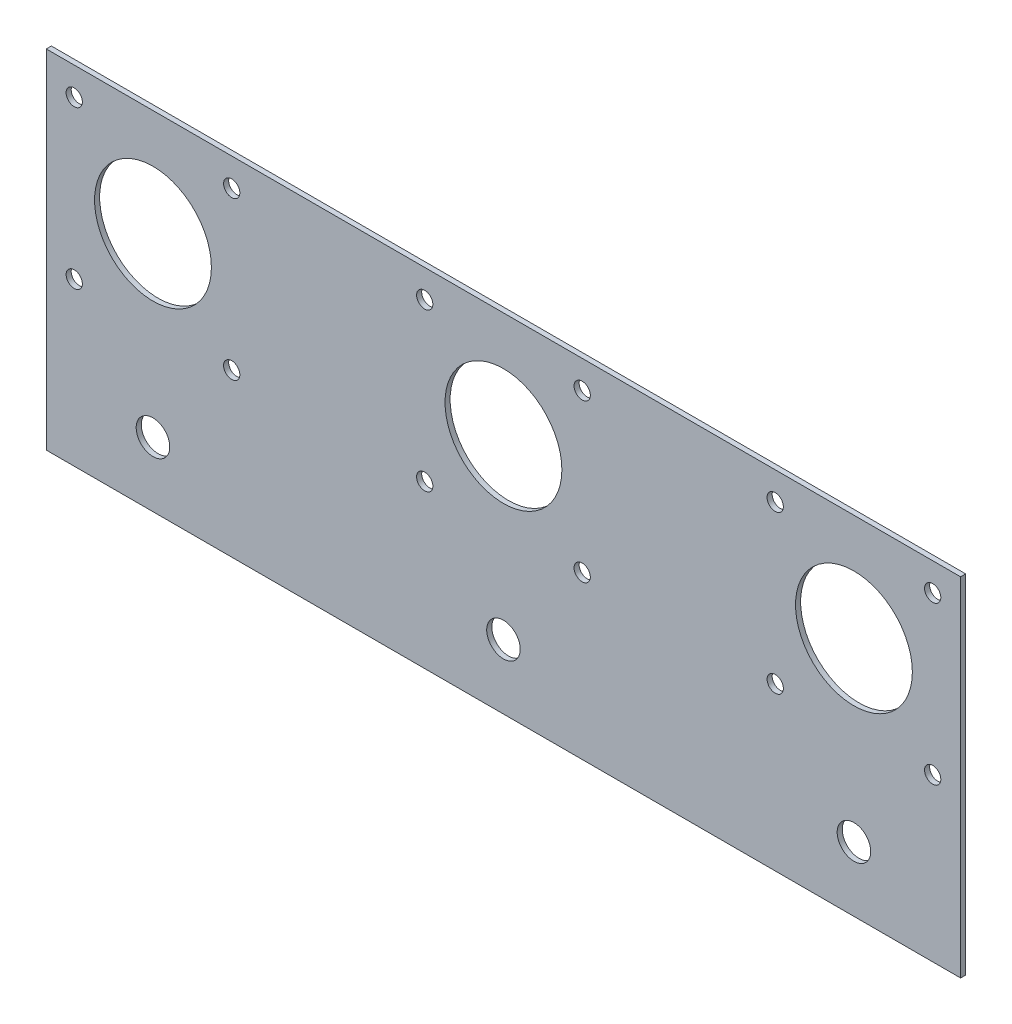
ISO-10303-21;
HEADER;
FILE_DESCRIPTION(('STEP AP214'),'2;1');
FILE_NAME('part.step','',(''),(''),'','','');
FILE_SCHEMA(('AUTOMOTIVE_DESIGN { 1 0 10303 214 1 1 1 1 }'));
ENDSEC;
DATA;
#1=APPLICATION_CONTEXT('core data for automotive mechanical design processes');
#2=APPLICATION_PROTOCOL_DEFINITION('international standard','automotive_design',2000,#1);
#3=PRODUCT_CONTEXT('',#1,'mechanical');
#4=PRODUCT('Part','Part','',(#3));
#5=PRODUCT_RELATED_PRODUCT_CATEGORY('part','',(#4));
#6=PRODUCT_DEFINITION_FORMATION('','',#4);
#7=PRODUCT_DEFINITION_CONTEXT('part definition',#1,'design');
#8=PRODUCT_DEFINITION('design','',#6,#7);
#9=PRODUCT_DEFINITION_SHAPE('','',#8);
#10=(LENGTH_UNIT() NAMED_UNIT(*) SI_UNIT(.MILLI.,.METRE.));
#11=(NAMED_UNIT(*) PLANE_ANGLE_UNIT() SI_UNIT($,.RADIAN.));
#12=(NAMED_UNIT(*) SI_UNIT($,.STERADIAN.) SOLID_ANGLE_UNIT());
#13=UNCERTAINTY_MEASURE_WITH_UNIT(LENGTH_MEASURE(1.E-05),#10,'distance_accuracy_value','');
#14=(GEOMETRIC_REPRESENTATION_CONTEXT(3) GLOBAL_UNCERTAINTY_ASSIGNED_CONTEXT((#13)) GLOBAL_UNIT_ASSIGNED_CONTEXT((#10,
#11,#12)) REPRESENTATION_CONTEXT('',''));
#15=CARTESIAN_POINT('',(0.,0.,0.));
#16=DIRECTION('',(0.,0.,1.));
#17=DIRECTION('',(1.,0.,0.));
#18=AXIS2_PLACEMENT_3D('',#15,#16,#17);
#19=CARTESIAN_POINT('',(143.5,31.8999999999999,0.));
#20=DIRECTION('',(0.,0.,1.));
#21=DIRECTION('',(1.,0.,0.));
#22=AXIS2_PLACEMENT_3D('',#19,#20,#21);
#23=CYLINDRICAL_SURFACE('',#22,1.6);
#24=CARTESIAN_POINT('',(143.5,31.8999999999999,0.));
#25=DIRECTION('',(0.,0.,1.));
#26=DIRECTION('',(1.,0.,0.));
#27=AXIS2_PLACEMENT_3D('',#24,#25,#26);
#28=CIRCLE('',#27,1.6);
#29=CARTESIAN_POINT('',(145.1,31.8999999999999,0.));
#30=VERTEX_POINT('',#29);
#31=EDGE_CURVE('E43',#30,#30,#28,.T.);
#32=ORIENTED_EDGE('',*,*,#31,.F.);
#33=EDGE_LOOP('',(#32));
#34=FACE_BOUND('',#33,.T.);
#35=CARTESIAN_POINT('',(143.5,31.8999999999999,1.));
#36=DIRECTION('',(0.,0.,1.));
#37=DIRECTION('',(1.,0.,0.));
#38=AXIS2_PLACEMENT_3D('',#35,#36,#37);
#39=CIRCLE('',#38,1.6);
#40=CARTESIAN_POINT('',(145.1,31.8999999999999,1.));
#41=VERTEX_POINT('',#40);
#42=EDGE_CURVE('E11',#41,#41,#39,.T.);
#43=ORIENTED_EDGE('',*,*,#42,.T.);
#44=EDGE_LOOP('',(#43));
#45=FACE_BOUND('',#44,.T.);
#46=ADVANCED_FACE('F35',(#34,#45),#23,.F.);
#47=CARTESIAN_POINT('',(174.5,31.9,0.));
#48=DIRECTION('',(0.,0.,1.));
#49=DIRECTION('',(1.,0.,0.));
#50=AXIS2_PLACEMENT_3D('',#47,#48,#49);
#51=CYLINDRICAL_SURFACE('',#50,1.6);
#52=CARTESIAN_POINT('',(174.5,31.9,0.));
#53=DIRECTION('',(0.,0.,1.));
#54=DIRECTION('',(1.,0.,0.));
#55=AXIS2_PLACEMENT_3D('',#52,#53,#54);
#56=CIRCLE('',#55,1.6);
#57=CARTESIAN_POINT('',(176.1,31.9,0.));
#58=VERTEX_POINT('',#57);
#59=EDGE_CURVE('E131',#58,#58,#56,.T.);
#60=ORIENTED_EDGE('',*,*,#59,.F.);
#61=EDGE_LOOP('',(#60));
#62=FACE_BOUND('',#61,.T.);
#63=CARTESIAN_POINT('',(174.5,31.9,1.));
#64=DIRECTION('',(0.,0.,1.));
#65=DIRECTION('',(1.,0.,0.));
#66=AXIS2_PLACEMENT_3D('',#63,#64,#65);
#67=CIRCLE('',#66,1.6);
#68=CARTESIAN_POINT('',(176.1,31.9,1.));
#69=VERTEX_POINT('',#68);
#70=EDGE_CURVE('E134',#69,#69,#67,.T.);
#71=ORIENTED_EDGE('',*,*,#70,.T.);
#72=EDGE_LOOP('',(#71));
#73=FACE_BOUND('',#72,.T.);
#74=ADVANCED_FACE('F143',(#62,#73),#51,.F.);
#75=CARTESIAN_POINT('',(174.5,62.9,0.));
#76=DIRECTION('',(0.,0.,1.));
#77=DIRECTION('',(1.,0.,0.));
#78=AXIS2_PLACEMENT_3D('',#75,#76,#77);
#79=CYLINDRICAL_SURFACE('',#78,1.6);
#80=CARTESIAN_POINT('',(174.5,62.9,0.));
#81=DIRECTION('',(0.,0.,1.));
#82=DIRECTION('',(1.,0.,0.));
#83=AXIS2_PLACEMENT_3D('',#80,#81,#82);
#84=CIRCLE('',#83,1.6);
#85=CARTESIAN_POINT('',(176.1,62.9,0.));
#86=VERTEX_POINT('',#85);
#87=EDGE_CURVE('E125',#86,#86,#84,.T.);
#88=ORIENTED_EDGE('',*,*,#87,.F.);
#89=EDGE_LOOP('',(#88));
#90=FACE_BOUND('',#89,.T.);
#91=CARTESIAN_POINT('',(174.5,62.9,1.));
#92=DIRECTION('',(0.,0.,1.));
#93=DIRECTION('',(1.,0.,0.));
#94=AXIS2_PLACEMENT_3D('',#91,#92,#93);
#95=CIRCLE('',#94,1.6);
#96=CARTESIAN_POINT('',(176.1,62.9,1.));
#97=VERTEX_POINT('',#96);
#98=EDGE_CURVE('E128',#97,#97,#95,.T.);
#99=ORIENTED_EDGE('',*,*,#98,.T.);
#100=EDGE_LOOP('',(#99));
#101=FACE_BOUND('',#100,.T.);
#102=ADVANCED_FACE('F178',(#90,#101),#79,.F.);
#103=CARTESIAN_POINT('',(159.,47.4,0.));
#104=DIRECTION('',(0.,0.,1.));
#105=DIRECTION('',(1.,0.,0.));
#106=AXIS2_PLACEMENT_3D('',#103,#104,#105);
#107=CYLINDRICAL_SURFACE('',#106,11.5);
#108=CARTESIAN_POINT('',(159.,47.4,0.));
#109=DIRECTION('',(0.,0.,1.));
#110=DIRECTION('',(1.,0.,0.));
#111=AXIS2_PLACEMENT_3D('',#108,#109,#110);
#112=CIRCLE('',#111,11.5);
#113=CARTESIAN_POINT('',(170.5,47.4,0.));
#114=VERTEX_POINT('',#113);
#115=EDGE_CURVE('E119',#114,#114,#112,.T.);
#116=ORIENTED_EDGE('',*,*,#115,.F.);
#117=EDGE_LOOP('',(#116));
#118=FACE_BOUND('',#117,.T.);
#119=CARTESIAN_POINT('',(159.,47.4,1.));
#120=DIRECTION('',(0.,0.,1.));
#121=DIRECTION('',(1.,0.,0.));
#122=AXIS2_PLACEMENT_3D('',#119,#120,#121);
#123=CIRCLE('',#122,11.5);
#124=CARTESIAN_POINT('',(170.5,47.4,1.));
#125=VERTEX_POINT('',#124);
#126=EDGE_CURVE('E122',#125,#125,#123,.T.);
#127=ORIENTED_EDGE('',*,*,#126,.T.);
#128=EDGE_LOOP('',(#127));
#129=FACE_BOUND('',#128,.T.);
#130=ADVANCED_FACE('F157',(#118,#129),#107,.F.);
#131=CARTESIAN_POINT('',(143.5,62.9,0.));
#132=DIRECTION('',(0.,0.,1.));
#133=DIRECTION('',(1.,0.,0.));
#134=AXIS2_PLACEMENT_3D('',#131,#132,#133);
#135=CYLINDRICAL_SURFACE('',#134,1.6);
#136=CARTESIAN_POINT('',(143.5,62.9,0.));
#137=DIRECTION('',(0.,0.,1.));
#138=DIRECTION('',(1.,0.,0.));
#139=AXIS2_PLACEMENT_3D('',#136,#137,#138);
#140=CIRCLE('',#139,1.6);
#141=CARTESIAN_POINT('',(145.1,62.9,0.));
#142=VERTEX_POINT('',#141);
#143=EDGE_CURVE('E113',#142,#142,#140,.T.);
#144=ORIENTED_EDGE('',*,*,#143,.F.);
#145=EDGE_LOOP('',(#144));
#146=FACE_BOUND('',#145,.T.);
#147=CARTESIAN_POINT('',(143.5,62.9,1.));
#148=DIRECTION('',(0.,0.,1.));
#149=DIRECTION('',(1.,0.,0.));
#150=AXIS2_PLACEMENT_3D('',#147,#148,#149);
#151=CIRCLE('',#150,1.6);
#152=CARTESIAN_POINT('',(145.1,62.9,1.));
#153=VERTEX_POINT('',#152);
#154=EDGE_CURVE('E116',#153,#153,#151,.T.);
#155=ORIENTED_EDGE('',*,*,#154,.T.);
#156=EDGE_LOOP('',(#155));
#157=FACE_BOUND('',#156,.T.);
#158=ADVANCED_FACE('F147',(#146,#157),#135,.F.);
#159=CARTESIAN_POINT('',(0.,0.,1.));
#160=DIRECTION('',(0.,0.,-1.));
#161=DIRECTION('',(-1.,0.,0.));
#162=AXIS2_PLACEMENT_3D('',#159,#160,#161);
#163=PLANE('',#162);
#164=CARTESIAN_POINT('',(74.5,31.9,1.));
#165=DIRECTION('',(0.,0.,1.));
#166=DIRECTION('',(1.,0.,0.));
#167=AXIS2_PLACEMENT_3D('',#164,#165,#166);
#168=CIRCLE('',#167,1.6);
#169=CARTESIAN_POINT('',(76.1,31.9,1.));
#170=VERTEX_POINT('',#169);
#171=EDGE_CURVE('E399',#170,#170,#168,.T.);
#172=ORIENTED_EDGE('',*,*,#171,.F.);
#173=EDGE_LOOP('',(#172));
#174=FACE_BOUND('',#173,.T.);
#175=CARTESIAN_POINT('',(105.5,31.9,1.));
#176=DIRECTION('',(0.,0.,1.));
#177=DIRECTION('',(1.,0.,0.));
#178=AXIS2_PLACEMENT_3D('',#175,#176,#177);
#179=CIRCLE('',#178,1.6);
#180=CARTESIAN_POINT('',(107.1,31.9,1.));
#181=VERTEX_POINT('',#180);
#182=EDGE_CURVE('E393',#181,#181,#179,.T.);
#183=ORIENTED_EDGE('',*,*,#182,.F.);
#184=EDGE_LOOP('',(#183));
#185=FACE_BOUND('',#184,.T.);
#186=CARTESIAN_POINT('',(105.5,62.9,1.));
#187=DIRECTION('',(0.,0.,1.));
#188=DIRECTION('',(1.,0.,0.));
#189=AXIS2_PLACEMENT_3D('',#186,#187,#188);
#190=CIRCLE('',#189,1.6);
#191=CARTESIAN_POINT('',(107.1,62.9,1.));
#192=VERTEX_POINT('',#191);
#193=EDGE_CURVE('E387',#192,#192,#190,.T.);
#194=ORIENTED_EDGE('',*,*,#193,.F.);
#195=EDGE_LOOP('',(#194));
#196=FACE_BOUND('',#195,.T.);
#197=CARTESIAN_POINT('',(90.,47.4,1.));
#198=DIRECTION('',(0.,0.,1.));
#199=DIRECTION('',(1.,0.,0.));
#200=AXIS2_PLACEMENT_3D('',#197,#198,#199);
#201=CIRCLE('',#200,11.5);
#202=CARTESIAN_POINT('',(101.5,47.4,1.));
#203=VERTEX_POINT('',#202);
#204=EDGE_CURVE('E381',#203,#203,#201,.T.);
#205=ORIENTED_EDGE('',*,*,#204,.F.);
#206=EDGE_LOOP('',(#205));
#207=FACE_BOUND('',#206,.T.);
#208=CARTESIAN_POINT('',(74.5,62.9,1.));
#209=DIRECTION('',(0.,0.,1.));
#210=DIRECTION('',(1.,0.,0.));
#211=AXIS2_PLACEMENT_3D('',#208,#209,#210);
#212=CIRCLE('',#211,1.6);
#213=CARTESIAN_POINT('',(76.1,62.9,1.));
#214=VERTEX_POINT('',#213);
#215=EDGE_CURVE('E356',#214,#214,#212,.T.);
#216=ORIENTED_EDGE('',*,*,#215,.F.);
#217=EDGE_LOOP('',(#216));
#218=FACE_BOUND('',#217,.T.);
#219=CARTESIAN_POINT('',(5.49999999999999,62.9,1.));
#220=DIRECTION('',(0.,0.,1.));
#221=DIRECTION('',(1.,0.,0.));
#222=AXIS2_PLACEMENT_3D('',#219,#220,#221);
#223=CIRCLE('',#222,1.6);
#224=CARTESIAN_POINT('',(7.09999999999999,62.9,1.));
#225=VERTEX_POINT('',#224);
#226=EDGE_CURVE('E352',#225,#225,#223,.T.);
#227=ORIENTED_EDGE('',*,*,#226,.F.);
#228=EDGE_LOOP('',(#227));
#229=FACE_BOUND('',#228,.T.);
#230=CARTESIAN_POINT('',(5.49999999999999,31.9,1.));
#231=DIRECTION('',(0.,0.,1.));
#232=DIRECTION('',(1.,0.,0.));
#233=AXIS2_PLACEMENT_3D('',#230,#231,#232);
#234=CIRCLE('',#233,1.6);
#235=CARTESIAN_POINT('',(7.09999999999999,31.9,1.));
#236=VERTEX_POINT('',#235);
#237=EDGE_CURVE('E359',#236,#236,#234,.T.);
#238=ORIENTED_EDGE('',*,*,#237,.F.);
#239=EDGE_LOOP('',(#238));
#240=FACE_BOUND('',#239,.T.);
#241=CARTESIAN_POINT('',(36.5,31.9,1.));
#242=DIRECTION('',(0.,0.,1.));
#243=DIRECTION('',(1.,0.,0.));
#244=AXIS2_PLACEMENT_3D('',#241,#242,#243);
#245=CIRCLE('',#244,1.6);
#246=CARTESIAN_POINT('',(38.1,31.9,1.));
#247=VERTEX_POINT('',#246);
#248=EDGE_CURVE('E365',#247,#247,#245,.T.);
#249=ORIENTED_EDGE('',*,*,#248,.F.);
#250=EDGE_LOOP('',(#249));
#251=FACE_BOUND('',#250,.T.);
#252=CARTESIAN_POINT('',(36.5,62.9,1.));
#253=DIRECTION('',(0.,0.,1.));
#254=DIRECTION('',(1.,0.,0.));
#255=AXIS2_PLACEMENT_3D('',#252,#253,#254);
#256=CIRCLE('',#255,1.6);
#257=CARTESIAN_POINT('',(38.1,62.9,1.));
#258=VERTEX_POINT('',#257);
#259=EDGE_CURVE('E371',#258,#258,#256,.T.);
#260=ORIENTED_EDGE('',*,*,#259,.F.);
#261=EDGE_LOOP('',(#260));
#262=FACE_BOUND('',#261,.T.);
#263=CARTESIAN_POINT('',(21.,47.4,1.));
#264=DIRECTION('',(0.,0.,1.));
#265=DIRECTION('',(1.,0.,0.));
#266=AXIS2_PLACEMENT_3D('',#263,#264,#265);
#267=CIRCLE('',#266,11.5);
#268=CARTESIAN_POINT('',(32.5,47.4,1.));
#269=VERTEX_POINT('',#268);
#270=EDGE_CURVE('E346',#269,#269,#267,.T.);
#271=ORIENTED_EDGE('',*,*,#270,.F.);
#272=EDGE_LOOP('',(#271));
#273=FACE_BOUND('',#272,.T.);
#274=DIRECTION('',(0.,-1.,0.));
#275=VECTOR('',#274,1.);
#276=CARTESIAN_POINT('',(0.,0.,1.));
#277=LINE('',#276,#275);
#278=CARTESIAN_POINT('',(0.,68.4,1.));
#279=VERTEX_POINT('',#278);
#280=CARTESIAN_POINT('',(0.,0.,1.));
#281=VERTEX_POINT('',#280);
#282=EDGE_CURVE('E88',#279,#281,#277,.T.);
#283=ORIENTED_EDGE('',*,*,#282,.T.);
#284=DIRECTION('',(1.,0.,0.));
#285=VECTOR('',#284,1.);
#286=CARTESIAN_POINT('',(0.,0.,1.));
#287=LINE('',#286,#285);
#288=CARTESIAN_POINT('',(180.,0.,1.));
#289=VERTEX_POINT('',#288);
#290=EDGE_CURVE('E82',#281,#289,#287,.T.);
#291=ORIENTED_EDGE('',*,*,#290,.T.);
#292=DIRECTION('',(0.,1.,0.));
#293=VECTOR('',#292,1.);
#294=CARTESIAN_POINT('',(180.,0.,1.));
#295=LINE('',#294,#293);
#296=CARTESIAN_POINT('',(180.,68.4,1.));
#297=VERTEX_POINT('',#296);
#298=EDGE_CURVE('E86',#289,#297,#295,.T.);
#299=ORIENTED_EDGE('',*,*,#298,.T.);
#300=DIRECTION('',(-1.,0.,0.));
#301=VECTOR('',#300,1.);
#302=CARTESIAN_POINT('',(0.,68.4,1.));
#303=LINE('',#302,#301);
#304=EDGE_CURVE('E51',#297,#279,#303,.T.);
#305=ORIENTED_EDGE('',*,*,#304,.T.);
#306=EDGE_LOOP('',(#283,#291,#299,#305));
#307=FACE_BOUND('',#306,.T.);
#308=CARTESIAN_POINT('',(21.,12.7,1.));
#309=DIRECTION('',(0.,0.,1.));
#310=DIRECTION('',(1.,0.,0.));
#311=AXIS2_PLACEMENT_3D('',#308,#309,#310);
#312=CIRCLE('',#311,3.302);
#313=CARTESIAN_POINT('',(24.302,12.7,1.));
#314=VERTEX_POINT('',#313);
#315=EDGE_CURVE('E106',#314,#314,#312,.T.);
#316=ORIENTED_EDGE('',*,*,#315,.F.);
#317=EDGE_LOOP('',(#316));
#318=FACE_BOUND('',#317,.T.);
#319=CARTESIAN_POINT('',(90.,12.7,1.));
#320=DIRECTION('',(0.,0.,1.));
#321=DIRECTION('',(1.,0.,0.));
#322=AXIS2_PLACEMENT_3D('',#319,#320,#321);
#323=CIRCLE('',#322,3.302);
#324=CARTESIAN_POINT('',(93.302,12.7,1.));
#325=VERTEX_POINT('',#324);
#326=EDGE_CURVE('E305',#325,#325,#323,.T.);
#327=ORIENTED_EDGE('',*,*,#326,.F.);
#328=EDGE_LOOP('',(#327));
#329=FACE_BOUND('',#328,.T.);
#330=CARTESIAN_POINT('',(159.,12.7,1.));
#331=DIRECTION('',(0.,0.,1.));
#332=DIRECTION('',(1.,0.,0.));
#333=AXIS2_PLACEMENT_3D('',#330,#331,#332);
#334=CIRCLE('',#333,3.30200000000001);
#335=CARTESIAN_POINT('',(162.302,12.7,1.));
#336=VERTEX_POINT('',#335);
#337=EDGE_CURVE('E310',#336,#336,#334,.T.);
#338=ORIENTED_EDGE('',*,*,#337,.F.);
#339=EDGE_LOOP('',(#338));
#340=FACE_BOUND('',#339,.T.);
#341=ORIENTED_EDGE('',*,*,#154,.F.);
#342=EDGE_LOOP('',(#341));
#343=FACE_BOUND('',#342,.T.);
#344=ORIENTED_EDGE('',*,*,#126,.F.);
#345=EDGE_LOOP('',(#344));
#346=FACE_BOUND('',#345,.T.);
#347=ORIENTED_EDGE('',*,*,#98,.F.);
#348=EDGE_LOOP('',(#347));
#349=FACE_BOUND('',#348,.T.);
#350=ORIENTED_EDGE('',*,*,#70,.F.);
#351=EDGE_LOOP('',(#350));
#352=FACE_BOUND('',#351,.T.);
#353=ORIENTED_EDGE('',*,*,#42,.F.);
#354=EDGE_LOOP('',(#353));
#355=FACE_BOUND('',#354,.T.);
#356=ADVANCED_FACE('F83',(#174,#185,#196,#207,#218,#229,#240,#251,#262,#273,#307,#318,#329,#340,
#343,#346,#349,#352,#355),#163,.F.);
#357=CARTESIAN_POINT('',(0.,0.,0.));
#358=DIRECTION('',(0.,0.,-1.));
#359=DIRECTION('',(-1.,0.,0.));
#360=AXIS2_PLACEMENT_3D('',#357,#358,#359);
#361=PLANE('',#360);
#362=CARTESIAN_POINT('',(74.5,31.9,0.));
#363=DIRECTION('',(0.,0.,1.));
#364=DIRECTION('',(1.,0.,0.));
#365=AXIS2_PLACEMENT_3D('',#362,#363,#364);
#366=CIRCLE('',#365,1.6);
#367=CARTESIAN_POINT('',(76.1,31.9,0.));
#368=VERTEX_POINT('',#367);
#369=EDGE_CURVE('E402',#368,#368,#366,.T.);
#370=ORIENTED_EDGE('',*,*,#369,.T.);
#371=EDGE_LOOP('',(#370));
#372=FACE_BOUND('',#371,.T.);
#373=CARTESIAN_POINT('',(105.5,31.9,0.));
#374=DIRECTION('',(0.,0.,1.));
#375=DIRECTION('',(1.,0.,0.));
#376=AXIS2_PLACEMENT_3D('',#373,#374,#375);
#377=CIRCLE('',#376,1.6);
#378=CARTESIAN_POINT('',(107.1,31.9,0.));
#379=VERTEX_POINT('',#378);
#380=EDGE_CURVE('E396',#379,#379,#377,.T.);
#381=ORIENTED_EDGE('',*,*,#380,.T.);
#382=EDGE_LOOP('',(#381));
#383=FACE_BOUND('',#382,.T.);
#384=CARTESIAN_POINT('',(105.5,62.9,0.));
#385=DIRECTION('',(0.,0.,1.));
#386=DIRECTION('',(1.,0.,0.));
#387=AXIS2_PLACEMENT_3D('',#384,#385,#386);
#388=CIRCLE('',#387,1.6);
#389=CARTESIAN_POINT('',(107.1,62.9,0.));
#390=VERTEX_POINT('',#389);
#391=EDGE_CURVE('E390',#390,#390,#388,.T.);
#392=ORIENTED_EDGE('',*,*,#391,.T.);
#393=EDGE_LOOP('',(#392));
#394=FACE_BOUND('',#393,.T.);
#395=CARTESIAN_POINT('',(90.,47.4,0.));
#396=DIRECTION('',(0.,0.,1.));
#397=DIRECTION('',(1.,0.,0.));
#398=AXIS2_PLACEMENT_3D('',#395,#396,#397);
#399=CIRCLE('',#398,11.5);
#400=CARTESIAN_POINT('',(101.5,47.4,0.));
#401=VERTEX_POINT('',#400);
#402=EDGE_CURVE('E384',#401,#401,#399,.T.);
#403=ORIENTED_EDGE('',*,*,#402,.T.);
#404=EDGE_LOOP('',(#403));
#405=FACE_BOUND('',#404,.T.);
#406=CARTESIAN_POINT('',(74.5,62.9,0.));
#407=DIRECTION('',(0.,0.,1.));
#408=DIRECTION('',(1.,0.,0.));
#409=AXIS2_PLACEMENT_3D('',#406,#407,#408);
#410=CIRCLE('',#409,1.6);
#411=CARTESIAN_POINT('',(76.1,62.9,0.));
#412=VERTEX_POINT('',#411);
#413=EDGE_CURVE('E378',#412,#412,#410,.T.);
#414=ORIENTED_EDGE('',*,*,#413,.T.);
#415=EDGE_LOOP('',(#414));
#416=FACE_BOUND('',#415,.T.);
#417=CARTESIAN_POINT('',(5.49999999999999,62.9,0.));
#418=DIRECTION('',(0.,0.,1.));
#419=DIRECTION('',(1.,0.,0.));
#420=AXIS2_PLACEMENT_3D('',#417,#418,#419);
#421=CIRCLE('',#420,1.6);
#422=CARTESIAN_POINT('',(7.09999999999999,62.9,0.));
#423=VERTEX_POINT('',#422);
#424=EDGE_CURVE('E355',#423,#423,#421,.T.);
#425=ORIENTED_EDGE('',*,*,#424,.T.);
#426=EDGE_LOOP('',(#425));
#427=FACE_BOUND('',#426,.T.);
#428=CARTESIAN_POINT('',(5.49999999999999,31.9,0.));
#429=DIRECTION('',(0.,0.,1.));
#430=DIRECTION('',(1.,0.,0.));
#431=AXIS2_PLACEMENT_3D('',#428,#429,#430);
#432=CIRCLE('',#431,1.6);
#433=CARTESIAN_POINT('',(7.09999999999999,31.9,0.));
#434=VERTEX_POINT('',#433);
#435=EDGE_CURVE('E362',#434,#434,#432,.T.);
#436=ORIENTED_EDGE('',*,*,#435,.T.);
#437=EDGE_LOOP('',(#436));
#438=FACE_BOUND('',#437,.T.);
#439=CARTESIAN_POINT('',(36.5,31.9,0.));
#440=DIRECTION('',(0.,0.,1.));
#441=DIRECTION('',(1.,0.,0.));
#442=AXIS2_PLACEMENT_3D('',#439,#440,#441);
#443=CIRCLE('',#442,1.6);
#444=CARTESIAN_POINT('',(38.1,31.9,0.));
#445=VERTEX_POINT('',#444);
#446=EDGE_CURVE('E368',#445,#445,#443,.T.);
#447=ORIENTED_EDGE('',*,*,#446,.T.);
#448=EDGE_LOOP('',(#447));
#449=FACE_BOUND('',#448,.T.);
#450=CARTESIAN_POINT('',(36.5,62.9,0.));
#451=DIRECTION('',(0.,0.,1.));
#452=DIRECTION('',(1.,0.,0.));
#453=AXIS2_PLACEMENT_3D('',#450,#451,#452);
#454=CIRCLE('',#453,1.6);
#455=CARTESIAN_POINT('',(38.1,62.9,0.));
#456=VERTEX_POINT('',#455);
#457=EDGE_CURVE('E350',#456,#456,#454,.T.);
#458=ORIENTED_EDGE('',*,*,#457,.T.);
#459=EDGE_LOOP('',(#458));
#460=FACE_BOUND('',#459,.T.);
#461=CARTESIAN_POINT('',(21.,47.4,0.));
#462=DIRECTION('',(0.,0.,1.));
#463=DIRECTION('',(1.,0.,0.));
#464=AXIS2_PLACEMENT_3D('',#461,#462,#463);
#465=CIRCLE('',#464,11.5);
#466=CARTESIAN_POINT('',(32.5,47.4,0.));
#467=VERTEX_POINT('',#466);
#468=EDGE_CURVE('E344',#467,#467,#465,.T.);
#469=ORIENTED_EDGE('',*,*,#468,.T.);
#470=EDGE_LOOP('',(#469));
#471=FACE_BOUND('',#470,.T.);
#472=CARTESIAN_POINT('',(90.,12.7,0.));
#473=DIRECTION('',(0.,0.,1.));
#474=DIRECTION('',(1.,0.,0.));
#475=AXIS2_PLACEMENT_3D('',#472,#473,#474);
#476=CIRCLE('',#475,3.302);
#477=CARTESIAN_POINT('',(93.302,12.7,0.));
#478=VERTEX_POINT('',#477);
#479=EDGE_CURVE('E308',#478,#478,#476,.T.);
#480=ORIENTED_EDGE('',*,*,#479,.T.);
#481=EDGE_LOOP('',(#480));
#482=FACE_BOUND('',#481,.T.);
#483=DIRECTION('',(0.,-1.,0.));
#484=VECTOR('',#483,1.);
#485=CARTESIAN_POINT('',(0.,0.,0.));
#486=LINE('',#485,#484);
#487=CARTESIAN_POINT('',(0.,68.4,0.));
#488=VERTEX_POINT('',#487);
#489=CARTESIAN_POINT('',(0.,0.,0.));
#490=VERTEX_POINT('',#489);
#491=EDGE_CURVE('E103',#488,#490,#486,.T.);
#492=ORIENTED_EDGE('',*,*,#491,.F.);
#493=DIRECTION('',(-1.,0.,0.));
#494=VECTOR('',#493,1.);
#495=CARTESIAN_POINT('',(0.,68.4,0.));
#496=LINE('',#495,#494);
#497=CARTESIAN_POINT('',(180.,68.4,0.));
#498=VERTEX_POINT('',#497);
#499=EDGE_CURVE('E74',#498,#488,#496,.T.);
#500=ORIENTED_EDGE('',*,*,#499,.F.);
#501=DIRECTION('',(0.,1.,0.));
#502=VECTOR('',#501,1.);
#503=CARTESIAN_POINT('',(180.,0.,0.));
#504=LINE('',#503,#502);
#505=CARTESIAN_POINT('',(180.,0.,0.));
#506=VERTEX_POINT('',#505);
#507=EDGE_CURVE('E68',#506,#498,#504,.T.);
#508=ORIENTED_EDGE('',*,*,#507,.F.);
#509=DIRECTION('',(1.,0.,0.));
#510=VECTOR('',#509,1.);
#511=CARTESIAN_POINT('',(0.,0.,0.));
#512=LINE('',#511,#510);
#513=EDGE_CURVE('E93',#490,#506,#512,.T.);
#514=ORIENTED_EDGE('',*,*,#513,.F.);
#515=EDGE_LOOP('',(#492,#500,#508,#514));
#516=FACE_BOUND('',#515,.T.);
#517=CARTESIAN_POINT('',(21.,12.7,0.));
#518=DIRECTION('',(0.,0.,1.));
#519=DIRECTION('',(1.,0.,0.));
#520=AXIS2_PLACEMENT_3D('',#517,#518,#519);
#521=CIRCLE('',#520,3.302);
#522=CARTESIAN_POINT('',(24.302,12.7,0.));
#523=VERTEX_POINT('',#522);
#524=EDGE_CURVE('E312',#523,#523,#521,.T.);
#525=ORIENTED_EDGE('',*,*,#524,.T.);
#526=EDGE_LOOP('',(#525));
#527=FACE_BOUND('',#526,.T.);
#528=CARTESIAN_POINT('',(159.,12.7,0.));
#529=DIRECTION('',(0.,0.,1.));
#530=DIRECTION('',(1.,0.,0.));
#531=AXIS2_PLACEMENT_3D('',#528,#529,#530);
#532=CIRCLE('',#531,3.30200000000001);
#533=CARTESIAN_POINT('',(162.302,12.7,0.));
#534=VERTEX_POINT('',#533);
#535=EDGE_CURVE('E315',#534,#534,#532,.T.);
#536=ORIENTED_EDGE('',*,*,#535,.T.);
#537=EDGE_LOOP('',(#536));
#538=FACE_BOUND('',#537,.T.);
#539=ORIENTED_EDGE('',*,*,#143,.T.);
#540=EDGE_LOOP('',(#539));
#541=FACE_BOUND('',#540,.T.);
#542=ORIENTED_EDGE('',*,*,#115,.T.);
#543=EDGE_LOOP('',(#542));
#544=FACE_BOUND('',#543,.T.);
#545=ORIENTED_EDGE('',*,*,#87,.T.);
#546=EDGE_LOOP('',(#545));
#547=FACE_BOUND('',#546,.T.);
#548=ORIENTED_EDGE('',*,*,#59,.T.);
#549=EDGE_LOOP('',(#548));
#550=FACE_BOUND('',#549,.T.);
#551=ORIENTED_EDGE('',*,*,#31,.T.);
#552=EDGE_LOOP('',(#551));
#553=FACE_BOUND('',#552,.T.);
#554=ADVANCED_FACE('F139',(#372,#383,#394,#405,#416,#427,#438,#449,#460,#471,#482,#516,#527,
#538,#541,#544,#547,#550,#553),#361,.T.);
#555=CARTESIAN_POINT('',(0.,0.,1.));
#556=DIRECTION('',(1.,0.,0.));
#557=DIRECTION('',(0.,0.,-1.));
#558=AXIS2_PLACEMENT_3D('',#555,#556,#557);
#559=PLANE('',#558);
#560=ORIENTED_EDGE('',*,*,#491,.T.);
#561=DIRECTION('',(0.,0.,-1.));
#562=VECTOR('',#561,1.);
#563=CARTESIAN_POINT('',(0.,0.,1.));
#564=LINE('',#563,#562);
#565=EDGE_CURVE('E94',#281,#490,#564,.T.);
#566=ORIENTED_EDGE('',*,*,#565,.F.);
#567=ORIENTED_EDGE('',*,*,#282,.F.);
#568=DIRECTION('',(0.,0.,-1.));
#569=VECTOR('',#568,1.);
#570=CARTESIAN_POINT('',(0.,68.4,1.));
#571=LINE('',#570,#569);
#572=EDGE_CURVE('E99',#279,#488,#571,.T.);
#573=ORIENTED_EDGE('',*,*,#572,.T.);
#574=EDGE_LOOP('',(#560,#566,#567,#573));
#575=FACE_BOUND('',#574,.T.);
#576=ADVANCED_FACE('F154',(#575),#559,.F.);
#577=CARTESIAN_POINT('',(0.,0.,1.));
#578=DIRECTION('',(0.,1.,0.));
#579=DIRECTION('',(0.,0.,1.));
#580=AXIS2_PLACEMENT_3D('',#577,#578,#579);
#581=PLANE('',#580);
#582=ORIENTED_EDGE('',*,*,#513,.T.);
#583=DIRECTION('',(0.,0.,-1.));
#584=VECTOR('',#583,1.);
#585=CARTESIAN_POINT('',(180.,0.,1.));
#586=LINE('',#585,#584);
#587=EDGE_CURVE('E91',#289,#506,#586,.T.);
#588=ORIENTED_EDGE('',*,*,#587,.F.);
#589=ORIENTED_EDGE('',*,*,#290,.F.);
#590=ORIENTED_EDGE('',*,*,#565,.T.);
#591=EDGE_LOOP('',(#582,#588,#589,#590));
#592=FACE_BOUND('',#591,.T.);
#593=ADVANCED_FACE('F92',(#592),#581,.F.);
#594=CARTESIAN_POINT('',(180.,0.,1.));
#595=DIRECTION('',(-1.,0.,0.));
#596=DIRECTION('',(0.,0.,1.));
#597=AXIS2_PLACEMENT_3D('',#594,#595,#596);
#598=PLANE('',#597);
#599=ORIENTED_EDGE('',*,*,#507,.T.);
#600=DIRECTION('',(0.,0.,-1.));
#601=VECTOR('',#600,1.);
#602=CARTESIAN_POINT('',(180.,68.4,1.));
#603=LINE('',#602,#601);
#604=EDGE_CURVE('E95',#297,#498,#603,.T.);
#605=ORIENTED_EDGE('',*,*,#604,.F.);
#606=ORIENTED_EDGE('',*,*,#298,.F.);
#607=ORIENTED_EDGE('',*,*,#587,.T.);
#608=EDGE_LOOP('',(#599,#605,#606,#607));
#609=FACE_BOUND('',#608,.T.);
#610=ADVANCED_FACE('F97',(#609),#598,.F.);
#611=CARTESIAN_POINT('',(0.,68.4,1.));
#612=DIRECTION('',(0.,-1.,0.));
#613=DIRECTION('',(1.,0.,0.));
#614=AXIS2_PLACEMENT_3D('',#611,#612,#613);
#615=PLANE('',#614);
#616=ORIENTED_EDGE('',*,*,#499,.T.);
#617=ORIENTED_EDGE('',*,*,#572,.F.);
#618=ORIENTED_EDGE('',*,*,#304,.F.);
#619=ORIENTED_EDGE('',*,*,#604,.T.);
#620=EDGE_LOOP('',(#616,#617,#618,#619));
#621=FACE_BOUND('',#620,.T.);
#622=ADVANCED_FACE('F166',(#621),#615,.F.);
#623=CARTESIAN_POINT('',(21.,12.7,1.));
#624=DIRECTION('',(0.,0.,-1.));
#625=DIRECTION('',(-1.,0.,0.));
#626=AXIS2_PLACEMENT_3D('',#623,#624,#625);
#627=CYLINDRICAL_SURFACE('',#626,3.302);
#628=ORIENTED_EDGE('',*,*,#315,.T.);
#629=EDGE_LOOP('',(#628));
#630=FACE_BOUND('',#629,.T.);
#631=ORIENTED_EDGE('',*,*,#524,.F.);
#632=EDGE_LOOP('',(#631));
#633=FACE_BOUND('',#632,.T.);
#634=ADVANCED_FACE('F163',(#630,#633),#627,.F.);
#635=CARTESIAN_POINT('',(90.,12.7,1.));
#636=DIRECTION('',(0.,0.,-1.));
#637=DIRECTION('',(-1.,0.,0.));
#638=AXIS2_PLACEMENT_3D('',#635,#636,#637);
#639=CYLINDRICAL_SURFACE('',#638,3.302);
#640=ORIENTED_EDGE('',*,*,#326,.T.);
#641=EDGE_LOOP('',(#640));
#642=FACE_BOUND('',#641,.T.);
#643=ORIENTED_EDGE('',*,*,#479,.F.);
#644=EDGE_LOOP('',(#643));
#645=FACE_BOUND('',#644,.T.);
#646=ADVANCED_FACE('F294',(#642,#645),#639,.F.);
#647=CARTESIAN_POINT('',(159.,12.7,1.));
#648=DIRECTION('',(0.,0.,-1.));
#649=DIRECTION('',(-1.,0.,0.));
#650=AXIS2_PLACEMENT_3D('',#647,#648,#649);
#651=CYLINDRICAL_SURFACE('',#650,3.30200000000001);
#652=ORIENTED_EDGE('',*,*,#337,.T.);
#653=EDGE_LOOP('',(#652));
#654=FACE_BOUND('',#653,.T.);
#655=ORIENTED_EDGE('',*,*,#535,.F.);
#656=EDGE_LOOP('',(#655));
#657=FACE_BOUND('',#656,.T.);
#658=ADVANCED_FACE('F291',(#654,#657),#651,.F.);
#659=CARTESIAN_POINT('',(21.,47.4,0.));
#660=DIRECTION('',(0.,0.,1.));
#661=DIRECTION('',(1.,0.,0.));
#662=AXIS2_PLACEMENT_3D('',#659,#660,#661);
#663=CYLINDRICAL_SURFACE('',#662,11.5);
#664=ORIENTED_EDGE('',*,*,#468,.F.);
#665=EDGE_LOOP('',(#664));
#666=FACE_BOUND('',#665,.T.);
#667=ORIENTED_EDGE('',*,*,#270,.T.);
#668=EDGE_LOOP('',(#667));
#669=FACE_BOUND('',#668,.T.);
#670=ADVANCED_FACE('F278',(#666,#669),#663,.F.);
#671=CARTESIAN_POINT('',(36.5,62.9,0.));
#672=DIRECTION('',(0.,0.,1.));
#673=DIRECTION('',(1.,0.,0.));
#674=AXIS2_PLACEMENT_3D('',#671,#672,#673);
#675=CYLINDRICAL_SURFACE('',#674,1.6);
#676=ORIENTED_EDGE('',*,*,#457,.F.);
#677=EDGE_LOOP('',(#676));
#678=FACE_BOUND('',#677,.T.);
#679=ORIENTED_EDGE('',*,*,#259,.T.);
#680=EDGE_LOOP('',(#679));
#681=FACE_BOUND('',#680,.T.);
#682=ADVANCED_FACE('F274',(#678,#681),#675,.F.);
#683=CARTESIAN_POINT('',(36.5,31.9,0.));
#684=DIRECTION('',(0.,0.,1.));
#685=DIRECTION('',(1.,0.,0.));
#686=AXIS2_PLACEMENT_3D('',#683,#684,#685);
#687=CYLINDRICAL_SURFACE('',#686,1.6);
#688=ORIENTED_EDGE('',*,*,#446,.F.);
#689=EDGE_LOOP('',(#688));
#690=FACE_BOUND('',#689,.T.);
#691=ORIENTED_EDGE('',*,*,#248,.T.);
#692=EDGE_LOOP('',(#691));
#693=FACE_BOUND('',#692,.T.);
#694=ADVANCED_FACE('F277',(#690,#693),#687,.F.);
#695=CARTESIAN_POINT('',(5.49999999999999,31.9,0.));
#696=DIRECTION('',(0.,0.,1.));
#697=DIRECTION('',(1.,0.,0.));
#698=AXIS2_PLACEMENT_3D('',#695,#696,#697);
#699=CYLINDRICAL_SURFACE('',#698,1.6);
#700=ORIENTED_EDGE('',*,*,#435,.F.);
#701=EDGE_LOOP('',(#700));
#702=FACE_BOUND('',#701,.T.);
#703=ORIENTED_EDGE('',*,*,#237,.T.);
#704=EDGE_LOOP('',(#703));
#705=FACE_BOUND('',#704,.T.);
#706=ADVANCED_FACE('F282',(#702,#705),#699,.F.);
#707=CARTESIAN_POINT('',(5.49999999999999,62.9,0.));
#708=DIRECTION('',(0.,0.,1.));
#709=DIRECTION('',(1.,0.,0.));
#710=AXIS2_PLACEMENT_3D('',#707,#708,#709);
#711=CYLINDRICAL_SURFACE('',#710,1.6);
#712=ORIENTED_EDGE('',*,*,#424,.F.);
#713=EDGE_LOOP('',(#712));
#714=FACE_BOUND('',#713,.T.);
#715=ORIENTED_EDGE('',*,*,#226,.T.);
#716=EDGE_LOOP('',(#715));
#717=FACE_BOUND('',#716,.T.);
#718=ADVANCED_FACE('F226',(#714,#717),#711,.F.);
#719=CARTESIAN_POINT('',(74.5,62.9,0.));
#720=DIRECTION('',(0.,0.,1.));
#721=DIRECTION('',(1.,0.,0.));
#722=AXIS2_PLACEMENT_3D('',#719,#720,#721);
#723=CYLINDRICAL_SURFACE('',#722,1.6);
#724=ORIENTED_EDGE('',*,*,#413,.F.);
#725=EDGE_LOOP('',(#724));
#726=FACE_BOUND('',#725,.T.);
#727=ORIENTED_EDGE('',*,*,#215,.T.);
#728=EDGE_LOOP('',(#727));
#729=FACE_BOUND('',#728,.T.);
#730=ADVANCED_FACE('F221',(#726,#729),#723,.F.);
#731=CARTESIAN_POINT('',(90.,47.4,0.));
#732=DIRECTION('',(0.,0.,1.));
#733=DIRECTION('',(1.,0.,0.));
#734=AXIS2_PLACEMENT_3D('',#731,#732,#733);
#735=CYLINDRICAL_SURFACE('',#734,11.5);
#736=ORIENTED_EDGE('',*,*,#402,.F.);
#737=EDGE_LOOP('',(#736));
#738=FACE_BOUND('',#737,.T.);
#739=ORIENTED_EDGE('',*,*,#204,.T.);
#740=EDGE_LOOP('',(#739));
#741=FACE_BOUND('',#740,.T.);
#742=ADVANCED_FACE('F225',(#738,#741),#735,.F.);
#743=CARTESIAN_POINT('',(105.5,62.9,0.));
#744=DIRECTION('',(0.,0.,1.));
#745=DIRECTION('',(1.,0.,0.));
#746=AXIS2_PLACEMENT_3D('',#743,#744,#745);
#747=CYLINDRICAL_SURFACE('',#746,1.6);
#748=ORIENTED_EDGE('',*,*,#391,.F.);
#749=EDGE_LOOP('',(#748));
#750=FACE_BOUND('',#749,.T.);
#751=ORIENTED_EDGE('',*,*,#193,.T.);
#752=EDGE_LOOP('',(#751));
#753=FACE_BOUND('',#752,.T.);
#754=ADVANCED_FACE('F237',(#750,#753),#747,.F.);
#755=CARTESIAN_POINT('',(105.5,31.9,0.));
#756=DIRECTION('',(0.,0.,1.));
#757=DIRECTION('',(1.,0.,0.));
#758=AXIS2_PLACEMENT_3D('',#755,#756,#757);
#759=CYLINDRICAL_SURFACE('',#758,1.6);
#760=ORIENTED_EDGE('',*,*,#380,.F.);
#761=EDGE_LOOP('',(#760));
#762=FACE_BOUND('',#761,.T.);
#763=ORIENTED_EDGE('',*,*,#182,.T.);
#764=EDGE_LOOP('',(#763));
#765=FACE_BOUND('',#764,.T.);
#766=ADVANCED_FACE('F247',(#762,#765),#759,.F.);
#767=CARTESIAN_POINT('',(74.5,31.9,0.));
#768=DIRECTION('',(0.,0.,1.));
#769=DIRECTION('',(1.,0.,0.));
#770=AXIS2_PLACEMENT_3D('',#767,#768,#769);
#771=CYLINDRICAL_SURFACE('',#770,1.6);
#772=ORIENTED_EDGE('',*,*,#369,.F.);
#773=EDGE_LOOP('',(#772));
#774=FACE_BOUND('',#773,.T.);
#775=ORIENTED_EDGE('',*,*,#171,.T.);
#776=EDGE_LOOP('',(#775));
#777=FACE_BOUND('',#776,.T.);
#778=ADVANCED_FACE('F257',(#774,#777),#771,.F.);
#779=CLOSED_SHELL('',(#46,#74,#102,#130,#158,#356,#554,#576,#593,#610,#622,#634,#646,#658,#670,
#682,#694,#706,#718,#730,#742,#754,#766,#778));
#780=MANIFOLD_SOLID_BREP('B2',#779);
#781=ADVANCED_BREP_SHAPE_REPRESENTATION('',(#18,#780),#14);
#782=SHAPE_DEFINITION_REPRESENTATION(#9,#781);
ENDSEC;
END-ISO-10303-21;
